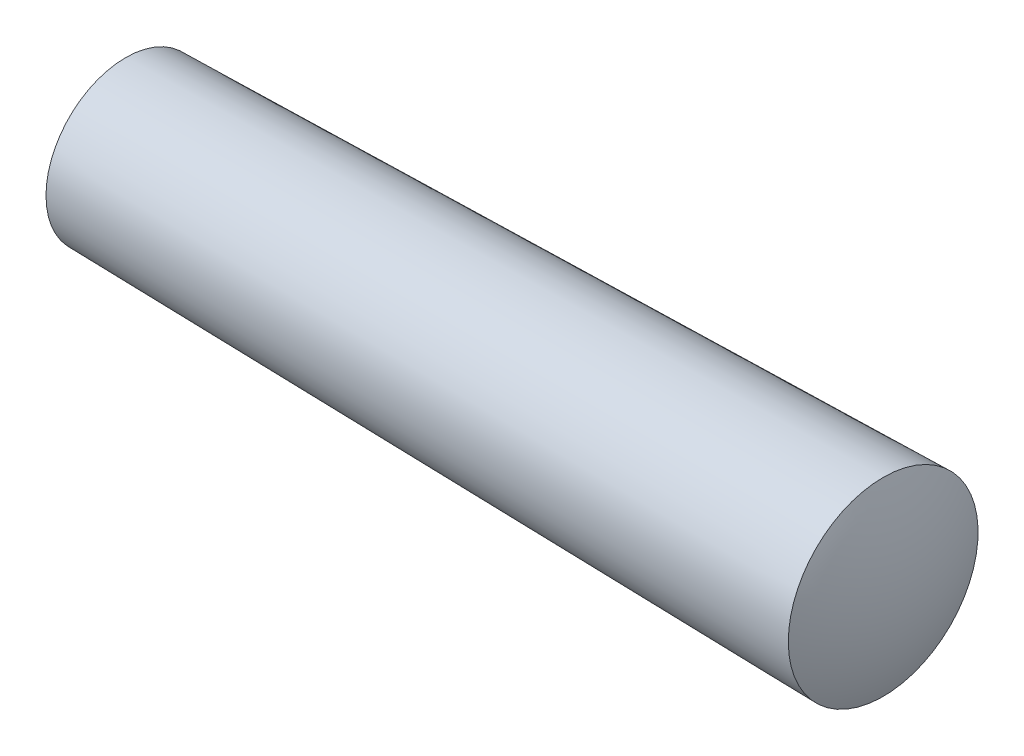
ISO-10303-21;
HEADER;
FILE_DESCRIPTION(('STEP AP214'),'2;1');
FILE_NAME('part.step','',(''),(''),'','','');
FILE_SCHEMA(('AUTOMOTIVE_DESIGN { 1 0 10303 214 1 1 1 1 }'));
ENDSEC;
DATA;
#1=APPLICATION_CONTEXT('core data for automotive mechanical design processes');
#2=APPLICATION_PROTOCOL_DEFINITION('international standard','automotive_design',2000,#1);
#3=PRODUCT_CONTEXT('',#1,'mechanical');
#4=PRODUCT('Part','Part','',(#3));
#5=PRODUCT_RELATED_PRODUCT_CATEGORY('part','',(#4));
#6=PRODUCT_DEFINITION_FORMATION('','',#4);
#7=PRODUCT_DEFINITION_CONTEXT('part definition',#1,'design');
#8=PRODUCT_DEFINITION('design','',#6,#7);
#9=PRODUCT_DEFINITION_SHAPE('','',#8);
#10=(LENGTH_UNIT() NAMED_UNIT(*) SI_UNIT(.MILLI.,.METRE.));
#11=(NAMED_UNIT(*) PLANE_ANGLE_UNIT() SI_UNIT($,.RADIAN.));
#12=(NAMED_UNIT(*) SI_UNIT($,.STERADIAN.) SOLID_ANGLE_UNIT());
#13=UNCERTAINTY_MEASURE_WITH_UNIT(LENGTH_MEASURE(1.E-05),#10,'distance_accuracy_value','');
#14=(GEOMETRIC_REPRESENTATION_CONTEXT(3) GLOBAL_UNCERTAINTY_ASSIGNED_CONTEXT((#13)) GLOBAL_UNIT_ASSIGNED_CONTEXT((#10,
#11,#12)) REPRESENTATION_CONTEXT('',''));
#15=CARTESIAN_POINT('',(0.,0.,0.));
#16=DIRECTION('',(0.,0.,1.));
#17=DIRECTION('',(1.,0.,0.));
#18=AXIS2_PLACEMENT_3D('',#15,#16,#17);
#19=CARTESIAN_POINT('',(8.49999999999999,0.,0.));
#20=DIRECTION('',(-1.,0.,0.));
#21=DIRECTION('',(0.,1.,0.));
#22=AXIS2_PLACEMENT_3D('',#19,#20,#21);
#23=SPHERICAL_SURFACE('',#22,8.49999999999999);
#24=CARTESIAN_POINT('',(1.,0.,0.));
#25=DIRECTION('',(-1.,0.,0.));
#26=DIRECTION('',(0.,0.,1.));
#27=AXIS2_PLACEMENT_3D('',#24,#25,#26);
#28=CIRCLE('',#27,4.);
#29=CARTESIAN_POINT('',(1.,0.,4.));
#30=VERTEX_POINT('',#29);
#31=EDGE_CURVE('E41',#30,#30,#28,.T.);
#32=ORIENTED_EDGE('',*,*,#31,.T.);
#33=EDGE_LOOP('',(#32));
#34=FACE_BOUND('',#33,.T.);
#35=ADVANCED_FACE('F35',(#34),#23,.T.);
#36=CARTESIAN_POINT('',(28.1712,0.,0.));
#37=DIRECTION('',(-1.,0.,0.));
#38=DIRECTION('',(0.,1.,0.));
#39=AXIS2_PLACEMENT_3D('',#36,#37,#38);
#40=SPHERICAL_SURFACE('',#39,11.8288);
#41=CARTESIAN_POINT('',(39.,0.,0.));
#42=DIRECTION('',(-1.,0.,0.));
#43=DIRECTION('',(0.,0.,1.));
#44=AXIS2_PLACEMENT_3D('',#41,#42,#43);
#45=CIRCLE('',#44,4.76);
#46=CARTESIAN_POINT('',(39.,0.,4.76));
#47=VERTEX_POINT('',#46);
#48=EDGE_CURVE('E10',#47,#47,#45,.T.);
#49=ORIENTED_EDGE('',*,*,#48,.F.);
#50=EDGE_LOOP('',(#49));
#51=FACE_BOUND('',#50,.T.);
#52=ADVANCED_FACE('F50',(#51),#40,.T.);
#53=CARTESIAN_POINT('',(39.,0.,0.));
#54=DIRECTION('',(1.,0.,0.));
#55=DIRECTION('',(0.,0.,-1.));
#56=AXIS2_PLACEMENT_3D('',#53,#54,#55);
#57=CONICAL_SURFACE('',#56,4.76,0.0199973339731506);
#58=ORIENTED_EDGE('',*,*,#31,.F.);
#59=EDGE_LOOP('',(#58));
#60=FACE_BOUND('',#59,.T.);
#61=ORIENTED_EDGE('',*,*,#48,.T.);
#62=EDGE_LOOP('',(#61));
#63=FACE_BOUND('',#62,.T.);
#64=ADVANCED_FACE('F48',(#60,#63),#57,.T.);
#65=CLOSED_SHELL('',(#35,#52,#64));
#66=MANIFOLD_SOLID_BREP('B2',#65);
#67=ADVANCED_BREP_SHAPE_REPRESENTATION('',(#18,#66),#14);
#68=SHAPE_DEFINITION_REPRESENTATION(#9,#67);
ENDSEC;
END-ISO-10303-21;
